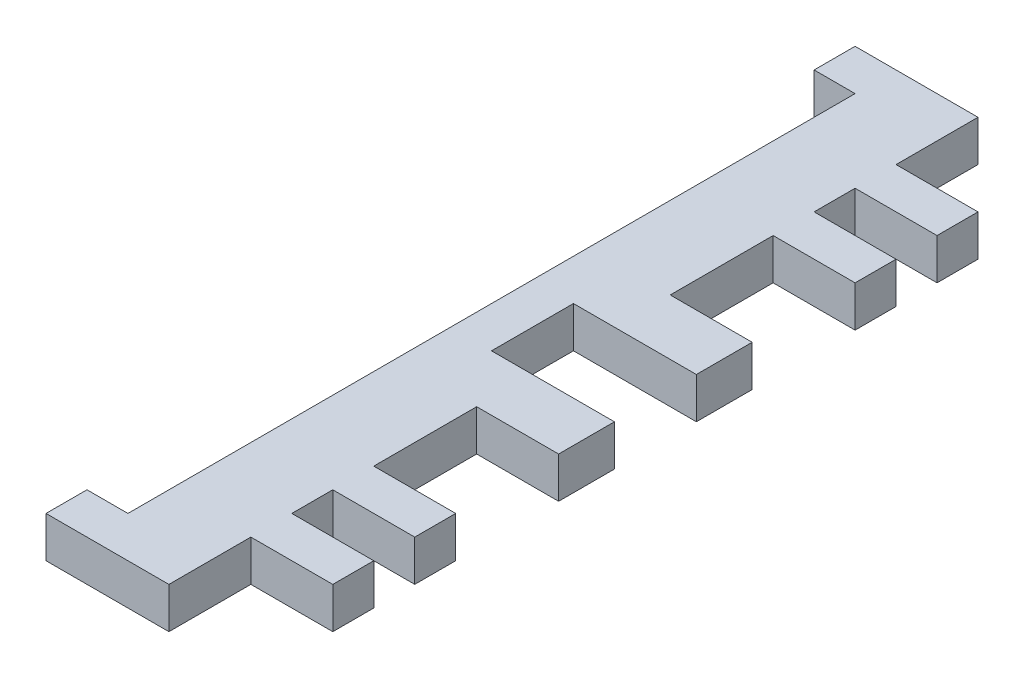
ISO-10303-21;
HEADER;
FILE_DESCRIPTION(('STEP AP214'),'2;1');
FILE_NAME('part.step','',(''),(''),'','','');
FILE_SCHEMA(('AUTOMOTIVE_DESIGN { 1 0 10303 214 1 1 1 1 }'));
ENDSEC;
DATA;
#1=APPLICATION_CONTEXT('core data for automotive mechanical design processes');
#2=APPLICATION_PROTOCOL_DEFINITION('international standard','automotive_design',2000,#1);
#3=PRODUCT_CONTEXT('',#1,'mechanical');
#4=PRODUCT('Part','Part','',(#3));
#5=PRODUCT_RELATED_PRODUCT_CATEGORY('part','',(#4));
#6=PRODUCT_DEFINITION_FORMATION('','',#4);
#7=PRODUCT_DEFINITION_CONTEXT('part definition',#1,'design');
#8=PRODUCT_DEFINITION('design','',#6,#7);
#9=PRODUCT_DEFINITION_SHAPE('','',#8);
#10=(LENGTH_UNIT() NAMED_UNIT(*) SI_UNIT(.MILLI.,.METRE.));
#11=(NAMED_UNIT(*) PLANE_ANGLE_UNIT() SI_UNIT($,.RADIAN.));
#12=(NAMED_UNIT(*) SI_UNIT($,.STERADIAN.) SOLID_ANGLE_UNIT());
#13=UNCERTAINTY_MEASURE_WITH_UNIT(LENGTH_MEASURE(1.E-05),#10,'distance_accuracy_value','');
#14=(GEOMETRIC_REPRESENTATION_CONTEXT(3) GLOBAL_UNCERTAINTY_ASSIGNED_CONTEXT((#13)) GLOBAL_UNIT_ASSIGNED_CONTEXT((#10,
#11,#12)) REPRESENTATION_CONTEXT('',''));
#15=CARTESIAN_POINT('',(0.,0.,0.));
#16=DIRECTION('',(0.,0.,1.));
#17=DIRECTION('',(1.,0.,0.));
#18=AXIS2_PLACEMENT_3D('',#15,#16,#17);
#19=CARTESIAN_POINT('',(-12.7,6.35,62.7));
#20=DIRECTION('',(0.,0.,-1.));
#21=DIRECTION('',(-1.,0.,0.));
#22=AXIS2_PLACEMENT_3D('',#19,#20,#21);
#23=PLANE('',#22);
#24=DIRECTION('',(0.,1.,0.));
#25=VECTOR('',#24,1.);
#26=CARTESIAN_POINT('',(-6.35,0.,62.7));
#27=LINE('',#26,#25);
#28=CARTESIAN_POINT('',(-6.35,0.,62.7));
#29=VERTEX_POINT('',#28);
#30=CARTESIAN_POINT('',(-6.35,6.35,62.7));
#31=VERTEX_POINT('',#30);
#32=EDGE_CURVE('E245',#29,#31,#27,.T.);
#33=ORIENTED_EDGE('',*,*,#32,.F.);
#34=DIRECTION('',(1.,0.,0.));
#35=VECTOR('',#34,1.);
#36=CARTESIAN_POINT('',(-12.7,0.,62.7));
#37=LINE('',#36,#35);
#38=CARTESIAN_POINT('',(12.7,0.,62.7));
#39=VERTEX_POINT('',#38);
#40=EDGE_CURVE('E255',#29,#39,#37,.T.);
#41=ORIENTED_EDGE('',*,*,#40,.T.);
#42=DIRECTION('',(0.,-1.,0.));
#43=VECTOR('',#42,1.);
#44=CARTESIAN_POINT('',(12.7,6.35,62.7));
#45=LINE('',#44,#43);
#46=CARTESIAN_POINT('',(12.7,6.35,62.7));
#47=VERTEX_POINT('',#46);
#48=EDGE_CURVE('E43',#47,#39,#45,.T.);
#49=ORIENTED_EDGE('',*,*,#48,.F.);
#50=DIRECTION('',(1.,0.,0.));
#51=VECTOR('',#50,1.);
#52=CARTESIAN_POINT('',(-12.7,6.35,62.7));
#53=LINE('',#52,#51);
#54=EDGE_CURVE('E257',#31,#47,#53,.T.);
#55=ORIENTED_EDGE('',*,*,#54,.F.);
#56=EDGE_LOOP('',(#33,#41,#49,#55));
#57=FACE_BOUND('',#56,.T.);
#58=ADVANCED_FACE('F35',(#57),#23,.F.);
#59=CARTESIAN_POINT('',(0.,6.35,0.));
#60=DIRECTION('',(0.,-1.,0.));
#61=DIRECTION('',(0.,0.,-1.));
#62=AXIS2_PLACEMENT_3D('',#59,#60,#61);
#63=PLANE('',#62);
#64=DIRECTION('',(0.,0.,1.));
#65=VECTOR('',#64,1.);
#66=CARTESIAN_POINT('',(-6.35,6.35,62.7));
#67=LINE('',#66,#65);
#68=CARTESIAN_POINT('',(-6.34999999999999,6.35000000000002,56.3499999999999));
#69=VERTEX_POINT('',#68);
#70=EDGE_CURVE('E50',#69,#31,#67,.T.);
#71=ORIENTED_EDGE('',*,*,#70,.T.);
#72=ORIENTED_EDGE('',*,*,#54,.T.);
#73=DIRECTION('',(0.,0.,-1.));
#74=VECTOR('',#73,1.);
#75=CARTESIAN_POINT('',(12.7,6.35,62.7));
#76=LINE('',#75,#74);
#77=CARTESIAN_POINT('',(12.7,6.35,50.));
#78=VERTEX_POINT('',#77);
#79=EDGE_CURVE('E279',#47,#78,#76,.T.);
#80=ORIENTED_EDGE('',*,*,#79,.T.);
#81=DIRECTION('',(-1.,0.,0.));
#82=VECTOR('',#81,1.);
#83=CARTESIAN_POINT('',(25.4,6.35,50.));
#84=LINE('',#83,#82);
#85=CARTESIAN_POINT('',(25.4,6.35,50.));
#86=VERTEX_POINT('',#85);
#87=EDGE_CURVE('E477',#86,#78,#84,.T.);
#88=ORIENTED_EDGE('',*,*,#87,.F.);
#89=DIRECTION('',(0.,0.,-1.));
#90=VECTOR('',#89,1.);
#91=CARTESIAN_POINT('',(25.4,6.35,43.65));
#92=LINE('',#91,#90);
#93=CARTESIAN_POINT('',(25.4,6.35,43.65));
#94=VERTEX_POINT('',#93);
#95=EDGE_CURVE('E474',#86,#94,#92,.T.);
#96=ORIENTED_EDGE('',*,*,#95,.T.);
#97=DIRECTION('',(-1.,0.,0.));
#98=VECTOR('',#97,1.);
#99=CARTESIAN_POINT('',(25.4,6.35,43.65));
#100=LINE('',#99,#98);
#101=CARTESIAN_POINT('',(12.7,6.35,43.65));
#102=VERTEX_POINT('',#101);
#103=EDGE_CURVE('E482',#94,#102,#100,.T.);
#104=ORIENTED_EDGE('',*,*,#103,.T.);
#105=CARTESIAN_POINT('',(12.7,6.35,37.3));
#106=VERTEX_POINT('',#105);
#107=EDGE_CURVE('E310',#102,#106,#76,.T.);
#108=ORIENTED_EDGE('',*,*,#107,.T.);
#109=DIRECTION('',(-1.,0.,0.));
#110=VECTOR('',#109,1.);
#111=CARTESIAN_POINT('',(25.4,6.35,37.3));
#112=LINE('',#111,#110);
#113=CARTESIAN_POINT('',(25.4,6.35,37.3));
#114=VERTEX_POINT('',#113);
#115=EDGE_CURVE('E448',#114,#106,#112,.T.);
#116=ORIENTED_EDGE('',*,*,#115,.F.);
#117=DIRECTION('',(0.,0.,-1.));
#118=VECTOR('',#117,1.);
#119=CARTESIAN_POINT('',(25.4,6.35,30.95));
#120=LINE('',#119,#118);
#121=CARTESIAN_POINT('',(25.4,6.35,30.95));
#122=VERTEX_POINT('',#121);
#123=EDGE_CURVE('E445',#114,#122,#120,.T.);
#124=ORIENTED_EDGE('',*,*,#123,.T.);
#125=DIRECTION('',(-1.,0.,0.));
#126=VECTOR('',#125,1.);
#127=CARTESIAN_POINT('',(25.4,6.35,30.95));
#128=LINE('',#127,#126);
#129=CARTESIAN_POINT('',(12.7,6.35,30.95));
#130=VERTEX_POINT('',#129);
#131=EDGE_CURVE('E454',#122,#130,#128,.T.);
#132=ORIENTED_EDGE('',*,*,#131,.T.);
#133=CARTESIAN_POINT('',(12.7,6.35,15.));
#134=VERTEX_POINT('',#133);
#135=EDGE_CURVE('E311',#130,#134,#76,.T.);
#136=ORIENTED_EDGE('',*,*,#135,.T.);
#137=DIRECTION('',(-1.,0.,0.));
#138=VECTOR('',#137,1.);
#139=CARTESIAN_POINT('',(25.4,6.35,15.));
#140=LINE('',#139,#138);
#141=CARTESIAN_POINT('',(25.4,6.35,15.));
#142=VERTEX_POINT('',#141);
#143=EDGE_CURVE('E380',#142,#134,#140,.T.);
#144=ORIENTED_EDGE('',*,*,#143,.F.);
#145=DIRECTION('',(0.,0.,1.));
#146=VECTOR('',#145,1.);
#147=CARTESIAN_POINT('',(25.4,6.35,6.35));
#148=LINE('',#147,#146);
#149=CARTESIAN_POINT('',(25.4,6.35,6.35));
#150=VERTEX_POINT('',#149);
#151=EDGE_CURVE('E378',#150,#142,#148,.T.);
#152=ORIENTED_EDGE('',*,*,#151,.F.);
#153=DIRECTION('',(1.,0.,0.));
#154=VECTOR('',#153,1.);
#155=CARTESIAN_POINT('',(6.35,6.35,6.35));
#156=LINE('',#155,#154);
#157=CARTESIAN_POINT('',(6.35,6.35,6.35));
#158=VERTEX_POINT('',#157);
#159=EDGE_CURVE('E405',#158,#150,#156,.T.);
#160=ORIENTED_EDGE('',*,*,#159,.F.);
#161=DIRECTION('',(0.,0.,1.));
#162=VECTOR('',#161,1.);
#163=CARTESIAN_POINT('',(6.35,6.35,6.35));
#164=LINE('',#163,#162);
#165=CARTESIAN_POINT('',(6.35,6.35,-6.35));
#166=VERTEX_POINT('',#165);
#167=EDGE_CURVE('E391',#166,#158,#164,.T.);
#168=ORIENTED_EDGE('',*,*,#167,.F.);
#169=DIRECTION('',(1.,0.,0.));
#170=VECTOR('',#169,1.);
#171=CARTESIAN_POINT('',(6.35,6.35,-6.35));
#172=LINE('',#171,#170);
#173=CARTESIAN_POINT('',(25.4,6.35,-6.35));
#174=VERTEX_POINT('',#173);
#175=EDGE_CURVE('E399',#166,#174,#172,.T.);
#176=ORIENTED_EDGE('',*,*,#175,.T.);
#177=DIRECTION('',(0.,0.,-1.));
#178=VECTOR('',#177,1.);
#179=CARTESIAN_POINT('',(25.4,6.35,-6.35));
#180=LINE('',#179,#178);
#181=CARTESIAN_POINT('',(25.4,6.35,-15.));
#182=VERTEX_POINT('',#181);
#183=EDGE_CURVE('E354',#174,#182,#180,.T.);
#184=ORIENTED_EDGE('',*,*,#183,.T.);
#185=DIRECTION('',(-1.,0.,0.));
#186=VECTOR('',#185,1.);
#187=CARTESIAN_POINT('',(25.4,6.35,-15.));
#188=LINE('',#187,#186);
#189=CARTESIAN_POINT('',(12.7,6.35,-15.));
#190=VERTEX_POINT('',#189);
#191=EDGE_CURVE('E366',#182,#190,#188,.T.);
#192=ORIENTED_EDGE('',*,*,#191,.T.);
#193=CARTESIAN_POINT('',(12.7,6.35,-30.95));
#194=VERTEX_POINT('',#193);
#195=EDGE_CURVE('E268',#190,#194,#76,.T.);
#196=ORIENTED_EDGE('',*,*,#195,.T.);
#197=DIRECTION('',(-1.,0.,0.));
#198=VECTOR('',#197,1.);
#199=CARTESIAN_POINT('',(25.4,6.35,-30.95));
#200=LINE('',#199,#198);
#201=CARTESIAN_POINT('',(25.4,6.35,-30.95));
#202=VERTEX_POINT('',#201);
#203=EDGE_CURVE('E509',#202,#194,#200,.T.);
#204=ORIENTED_EDGE('',*,*,#203,.F.);
#205=DIRECTION('',(0.,0.,1.));
#206=VECTOR('',#205,1.);
#207=CARTESIAN_POINT('',(25.4,6.35,-30.95));
#208=LINE('',#207,#206);
#209=CARTESIAN_POINT('',(25.4,6.35,-37.3));
#210=VERTEX_POINT('',#209);
#211=EDGE_CURVE('E494',#210,#202,#208,.T.);
#212=ORIENTED_EDGE('',*,*,#211,.F.);
#213=DIRECTION('',(-1.,0.,0.));
#214=VECTOR('',#213,1.);
#215=CARTESIAN_POINT('',(25.4,6.35,-37.3));
#216=LINE('',#215,#214);
#217=CARTESIAN_POINT('',(12.7,6.35,-37.3));
#218=VERTEX_POINT('',#217);
#219=EDGE_CURVE('E326',#210,#218,#216,.T.);
#220=ORIENTED_EDGE('',*,*,#219,.T.);
#221=CARTESIAN_POINT('',(12.7,6.35,-43.65));
#222=VERTEX_POINT('',#221);
#223=EDGE_CURVE('E266',#218,#222,#76,.T.);
#224=ORIENTED_EDGE('',*,*,#223,.T.);
#225=DIRECTION('',(-1.,0.,0.));
#226=VECTOR('',#225,1.);
#227=CARTESIAN_POINT('',(25.4,6.35,-43.65));
#228=LINE('',#227,#226);
#229=CARTESIAN_POINT('',(25.4,6.35,-43.65));
#230=VERTEX_POINT('',#229);
#231=EDGE_CURVE('E323',#230,#222,#228,.T.);
#232=ORIENTED_EDGE('',*,*,#231,.F.);
#233=DIRECTION('',(0.,0.,1.));
#234=VECTOR('',#233,1.);
#235=CARTESIAN_POINT('',(25.4,6.35,-43.65));
#236=LINE('',#235,#234);
#237=CARTESIAN_POINT('',(25.4,6.35,-50.));
#238=VERTEX_POINT('',#237);
#239=EDGE_CURVE('E514',#238,#230,#236,.T.);
#240=ORIENTED_EDGE('',*,*,#239,.F.);
#241=DIRECTION('',(-1.,0.,0.));
#242=VECTOR('',#241,1.);
#243=CARTESIAN_POINT('',(25.4,6.35,-50.));
#244=LINE('',#243,#242);
#245=CARTESIAN_POINT('',(12.7,6.35,-50.));
#246=VERTEX_POINT('',#245);
#247=EDGE_CURVE('E341',#238,#246,#244,.T.);
#248=ORIENTED_EDGE('',*,*,#247,.T.);
#249=CARTESIAN_POINT('',(12.7,6.35,-62.7));
#250=VERTEX_POINT('',#249);
#251=EDGE_CURVE('E263',#246,#250,#76,.T.);
#252=ORIENTED_EDGE('',*,*,#251,.T.);
#253=DIRECTION('',(-1.,0.,0.));
#254=VECTOR('',#253,1.);
#255=CARTESIAN_POINT('',(-12.7,6.35,-62.7));
#256=LINE('',#255,#254);
#257=CARTESIAN_POINT('',(-6.35,6.35,-62.7));
#258=VERTEX_POINT('',#257);
#259=EDGE_CURVE('E274',#250,#258,#256,.T.);
#260=ORIENTED_EDGE('',*,*,#259,.T.);
#261=DIRECTION('',(0.,0.,-1.));
#262=VECTOR('',#261,1.);
#263=CARTESIAN_POINT('',(-6.35,6.35,-62.7));
#264=LINE('',#263,#262);
#265=CARTESIAN_POINT('',(-6.34999999999999,6.35,-56.3500000000001));
#266=VERTEX_POINT('',#265);
#267=EDGE_CURVE('E424',#266,#258,#264,.T.);
#268=ORIENTED_EDGE('',*,*,#267,.F.);
#269=DIRECTION('',(-1.,0.,0.));
#270=VECTOR('',#269,1.);
#271=CARTESIAN_POINT('',(0.,6.34999999999999,-56.3500000000001));
#272=LINE('',#271,#270);
#273=CARTESIAN_POINT('',(0.,6.34999999999999,-56.3500000000001));
#274=VERTEX_POINT('',#273);
#275=EDGE_CURVE('E296',#274,#266,#272,.T.);
#276=ORIENTED_EDGE('',*,*,#275,.F.);
#277=DIRECTION('',(0.,0.,-1.));
#278=VECTOR('',#277,1.);
#279=CARTESIAN_POINT('',(0.,6.35000000000002,56.3499999999999));
#280=LINE('',#279,#278);
#281=CARTESIAN_POINT('',(0.,6.35000000000002,56.3499999999999));
#282=VERTEX_POINT('',#281);
#283=EDGE_CURVE('E412',#282,#274,#280,.T.);
#284=ORIENTED_EDGE('',*,*,#283,.F.);
#285=DIRECTION('',(-1.,0.,0.));
#286=VECTOR('',#285,1.);
#287=CARTESIAN_POINT('',(0.,6.35000000000002,56.3499999999999));
#288=LINE('',#287,#286);
#289=EDGE_CURVE('E301',#282,#69,#288,.T.);
#290=ORIENTED_EDGE('',*,*,#289,.T.);
#291=EDGE_LOOP('',(#71,#72,#80,#88,#96,#104,#108,#116,#124,#132,#136,#144,#152,#160,#168,#176,
#184,#192,#196,#204,#212,#220,#224,#232,#240,#248,#252,#260,#268,#276,#284,#290));
#292=FACE_BOUND('',#291,.T.);
#293=ADVANCED_FACE('F321',(#292),#63,.F.);
#294=CARTESIAN_POINT('',(0.,0.,0.));
#295=DIRECTION('',(0.,-1.,0.));
#296=DIRECTION('',(0.,0.,-1.));
#297=AXIS2_PLACEMENT_3D('',#294,#295,#296);
#298=PLANE('',#297);
#299=ORIENTED_EDGE('',*,*,#40,.F.);
#300=DIRECTION('',(0.,0.,1.));
#301=VECTOR('',#300,1.);
#302=CARTESIAN_POINT('',(-6.35,0.,62.7));
#303=LINE('',#302,#301);
#304=CARTESIAN_POINT('',(-6.34999999999999,0.,56.3500000000001));
#305=VERTEX_POINT('',#304);
#306=EDGE_CURVE('E242',#305,#29,#303,.T.);
#307=ORIENTED_EDGE('',*,*,#306,.F.);
#308=DIRECTION('',(-1.,0.,0.));
#309=VECTOR('',#308,1.);
#310=CARTESIAN_POINT('',(0.,0.,56.3499999999999));
#311=LINE('',#310,#309);
#312=CARTESIAN_POINT('',(0.,0.,56.3499999999999));
#313=VERTEX_POINT('',#312);
#314=EDGE_CURVE('E309',#313,#305,#311,.T.);
#315=ORIENTED_EDGE('',*,*,#314,.F.);
#316=DIRECTION('',(0.,0.,1.));
#317=VECTOR('',#316,1.);
#318=CARTESIAN_POINT('',(0.,0.,56.3499999999999));
#319=LINE('',#318,#317);
#320=CARTESIAN_POINT('',(0.,0.,-56.3500000000001));
#321=VERTEX_POINT('',#320);
#322=EDGE_CURVE('E402',#321,#313,#319,.T.);
#323=ORIENTED_EDGE('',*,*,#322,.F.);
#324=DIRECTION('',(-1.,0.,0.));
#325=VECTOR('',#324,1.);
#326=CARTESIAN_POINT('',(0.,0.,-56.3500000000001));
#327=LINE('',#326,#325);
#328=CARTESIAN_POINT('',(-6.34999999999999,0.,-56.3500000000001));
#329=VERTEX_POINT('',#328);
#330=EDGE_CURVE('E290',#321,#329,#327,.T.);
#331=ORIENTED_EDGE('',*,*,#330,.T.);
#332=DIRECTION('',(0.,0.,-1.));
#333=VECTOR('',#332,1.);
#334=CARTESIAN_POINT('',(-6.35,0.,-62.7));
#335=LINE('',#334,#333);
#336=CARTESIAN_POINT('',(-6.35,0.,-62.7));
#337=VERTEX_POINT('',#336);
#338=EDGE_CURVE('E58',#329,#337,#335,.T.);
#339=ORIENTED_EDGE('',*,*,#338,.T.);
#340=DIRECTION('',(-1.,0.,0.));
#341=VECTOR('',#340,1.);
#342=CARTESIAN_POINT('',(-12.7,0.,-62.7));
#343=LINE('',#342,#341);
#344=CARTESIAN_POINT('',(12.7,0.,-62.7));
#345=VERTEX_POINT('',#344);
#346=EDGE_CURVE('E264',#345,#337,#343,.T.);
#347=ORIENTED_EDGE('',*,*,#346,.F.);
#348=DIRECTION('',(0.,0.,-1.));
#349=VECTOR('',#348,1.);
#350=CARTESIAN_POINT('',(12.7,0.,62.7));
#351=LINE('',#350,#349);
#352=CARTESIAN_POINT('',(12.7,0.,-50.));
#353=VERTEX_POINT('',#352);
#354=EDGE_CURVE('E285',#353,#345,#351,.T.);
#355=ORIENTED_EDGE('',*,*,#354,.F.);
#356=DIRECTION('',(-1.,0.,0.));
#357=VECTOR('',#356,1.);
#358=CARTESIAN_POINT('',(25.4,0.,-50.));
#359=LINE('',#358,#357);
#360=CARTESIAN_POINT('',(25.4,0.,-50.));
#361=VERTEX_POINT('',#360);
#362=EDGE_CURVE('E347',#361,#353,#359,.T.);
#363=ORIENTED_EDGE('',*,*,#362,.F.);
#364=DIRECTION('',(0.,0.,-1.));
#365=VECTOR('',#364,1.);
#366=CARTESIAN_POINT('',(25.4,0.,-43.65));
#367=LINE('',#366,#365);
#368=CARTESIAN_POINT('',(25.4,0.,-43.65));
#369=VERTEX_POINT('',#368);
#370=EDGE_CURVE('E517',#369,#361,#367,.T.);
#371=ORIENTED_EDGE('',*,*,#370,.F.);
#372=DIRECTION('',(-1.,0.,0.));
#373=VECTOR('',#372,1.);
#374=CARTESIAN_POINT('',(25.4,0.,-43.65));
#375=LINE('',#374,#373);
#376=CARTESIAN_POINT('',(12.7,0.,-43.65));
#377=VERTEX_POINT('',#376);
#378=EDGE_CURVE('E342',#369,#377,#375,.T.);
#379=ORIENTED_EDGE('',*,*,#378,.T.);
#380=CARTESIAN_POINT('',(12.7,0.,-37.3));
#381=VERTEX_POINT('',#380);
#382=EDGE_CURVE('E284',#381,#377,#351,.T.);
#383=ORIENTED_EDGE('',*,*,#382,.F.);
#384=DIRECTION('',(-1.,0.,0.));
#385=VECTOR('',#384,1.);
#386=CARTESIAN_POINT('',(25.4,0.,-37.3));
#387=LINE('',#386,#385);
#388=CARTESIAN_POINT('',(25.4,0.,-37.3));
#389=VERTEX_POINT('',#388);
#390=EDGE_CURVE('E501',#389,#381,#387,.T.);
#391=ORIENTED_EDGE('',*,*,#390,.F.);
#392=DIRECTION('',(0.,0.,-1.));
#393=VECTOR('',#392,1.);
#394=CARTESIAN_POINT('',(25.4,0.,-30.95));
#395=LINE('',#394,#393);
#396=CARTESIAN_POINT('',(25.4,0.,-30.95));
#397=VERTEX_POINT('',#396);
#398=EDGE_CURVE('E499',#397,#389,#395,.T.);
#399=ORIENTED_EDGE('',*,*,#398,.F.);
#400=DIRECTION('',(-1.,0.,0.));
#401=VECTOR('',#400,1.);
#402=CARTESIAN_POINT('',(25.4,0.,-30.95));
#403=LINE('',#402,#401);
#404=CARTESIAN_POINT('',(12.7,0.,-30.95));
#405=VERTEX_POINT('',#404);
#406=EDGE_CURVE('E506',#397,#405,#403,.T.);
#407=ORIENTED_EDGE('',*,*,#406,.T.);
#408=CARTESIAN_POINT('',(12.7,0.,-15.));
#409=VERTEX_POINT('',#408);
#410=EDGE_CURVE('E283',#409,#405,#351,.T.);
#411=ORIENTED_EDGE('',*,*,#410,.F.);
#412=DIRECTION('',(-1.,0.,0.));
#413=VECTOR('',#412,1.);
#414=CARTESIAN_POINT('',(25.4,0.,-15.));
#415=LINE('',#414,#413);
#416=CARTESIAN_POINT('',(25.4,0.,-15.));
#417=VERTEX_POINT('',#416);
#418=EDGE_CURVE('E363',#417,#409,#415,.T.);
#419=ORIENTED_EDGE('',*,*,#418,.F.);
#420=DIRECTION('',(0.,0.,1.));
#421=VECTOR('',#420,1.);
#422=CARTESIAN_POINT('',(25.4,0.,-6.35));
#423=LINE('',#422,#421);
#424=CARTESIAN_POINT('',(25.4,0.,-6.35));
#425=VERTEX_POINT('',#424);
#426=EDGE_CURVE('E360',#417,#425,#423,.T.);
#427=ORIENTED_EDGE('',*,*,#426,.T.);
#428=DIRECTION('',(1.,0.,0.));
#429=VECTOR('',#428,1.);
#430=CARTESIAN_POINT('',(6.35,0.,-6.35));
#431=LINE('',#430,#429);
#432=CARTESIAN_POINT('',(6.35,0.,-6.35));
#433=VERTEX_POINT('',#432);
#434=EDGE_CURVE('E400',#433,#425,#431,.T.);
#435=ORIENTED_EDGE('',*,*,#434,.F.);
#436=DIRECTION('',(0.,0.,-1.));
#437=VECTOR('',#436,1.);
#438=CARTESIAN_POINT('',(6.35,0.,6.35));
#439=LINE('',#438,#437);
#440=CARTESIAN_POINT('',(6.35,0.,6.35));
#441=VERTEX_POINT('',#440);
#442=EDGE_CURVE('E396',#441,#433,#439,.T.);
#443=ORIENTED_EDGE('',*,*,#442,.F.);
#444=DIRECTION('',(1.,0.,0.));
#445=VECTOR('',#444,1.);
#446=CARTESIAN_POINT('',(6.35,0.,6.35));
#447=LINE('',#446,#445);
#448=CARTESIAN_POINT('',(25.4,0.,6.35));
#449=VERTEX_POINT('',#448);
#450=EDGE_CURVE('E403',#441,#449,#447,.T.);
#451=ORIENTED_EDGE('',*,*,#450,.T.);
#452=DIRECTION('',(0.,0.,-1.));
#453=VECTOR('',#452,1.);
#454=CARTESIAN_POINT('',(25.4,0.,6.35));
#455=LINE('',#454,#453);
#456=CARTESIAN_POINT('',(25.4,0.,15.));
#457=VERTEX_POINT('',#456);
#458=EDGE_CURVE('E372',#457,#449,#455,.T.);
#459=ORIENTED_EDGE('',*,*,#458,.F.);
#460=DIRECTION('',(-1.,0.,0.));
#461=VECTOR('',#460,1.);
#462=CARTESIAN_POINT('',(25.4,0.,15.));
#463=LINE('',#462,#461);
#464=CARTESIAN_POINT('',(12.7,0.,15.));
#465=VERTEX_POINT('',#464);
#466=EDGE_CURVE('E385',#457,#465,#463,.T.);
#467=ORIENTED_EDGE('',*,*,#466,.T.);
#468=CARTESIAN_POINT('',(12.7,0.,30.95));
#469=VERTEX_POINT('',#468);
#470=EDGE_CURVE('E282',#469,#465,#351,.T.);
#471=ORIENTED_EDGE('',*,*,#470,.F.);
#472=DIRECTION('',(-1.,0.,0.));
#473=VECTOR('',#472,1.);
#474=CARTESIAN_POINT('',(25.4,0.,30.95));
#475=LINE('',#474,#473);
#476=CARTESIAN_POINT('',(25.4,0.,30.95));
#477=VERTEX_POINT('',#476);
#478=EDGE_CURVE('E457',#477,#469,#475,.T.);
#479=ORIENTED_EDGE('',*,*,#478,.F.);
#480=DIRECTION('',(0.,0.,1.));
#481=VECTOR('',#480,1.);
#482=CARTESIAN_POINT('',(25.4,0.,30.95));
#483=LINE('',#482,#481);
#484=CARTESIAN_POINT('',(25.4,0.,37.3));
#485=VERTEX_POINT('',#484);
#486=EDGE_CURVE('E438',#477,#485,#483,.T.);
#487=ORIENTED_EDGE('',*,*,#486,.T.);
#488=DIRECTION('',(-1.,0.,0.));
#489=VECTOR('',#488,1.);
#490=CARTESIAN_POINT('',(25.4,0.,37.3));
#491=LINE('',#490,#489);
#492=CARTESIAN_POINT('',(12.7,0.,37.3));
#493=VERTEX_POINT('',#492);
#494=EDGE_CURVE('E460',#485,#493,#491,.T.);
#495=ORIENTED_EDGE('',*,*,#494,.T.);
#496=CARTESIAN_POINT('',(12.7,0.,43.65));
#497=VERTEX_POINT('',#496);
#498=EDGE_CURVE('E281',#497,#493,#351,.T.);
#499=ORIENTED_EDGE('',*,*,#498,.F.);
#500=DIRECTION('',(-1.,0.,0.));
#501=VECTOR('',#500,1.);
#502=CARTESIAN_POINT('',(25.4,0.,43.65));
#503=LINE('',#502,#501);
#504=CARTESIAN_POINT('',(25.4,0.,43.65));
#505=VERTEX_POINT('',#504);
#506=EDGE_CURVE('E485',#505,#497,#503,.T.);
#507=ORIENTED_EDGE('',*,*,#506,.F.);
#508=DIRECTION('',(0.,0.,1.));
#509=VECTOR('',#508,1.);
#510=CARTESIAN_POINT('',(25.4,0.,43.65));
#511=LINE('',#510,#509);
#512=CARTESIAN_POINT('',(25.4,0.,50.));
#513=VERTEX_POINT('',#512);
#514=EDGE_CURVE('E467',#505,#513,#511,.T.);
#515=ORIENTED_EDGE('',*,*,#514,.T.);
#516=DIRECTION('',(-1.,0.,0.));
#517=VECTOR('',#516,1.);
#518=CARTESIAN_POINT('',(25.4,0.,50.));
#519=LINE('',#518,#517);
#520=CARTESIAN_POINT('',(12.7,0.,50.));
#521=VERTEX_POINT('',#520);
#522=EDGE_CURVE('E488',#513,#521,#519,.T.);
#523=ORIENTED_EDGE('',*,*,#522,.T.);
#524=EDGE_CURVE('E262',#39,#521,#351,.T.);
#525=ORIENTED_EDGE('',*,*,#524,.F.);
#526=EDGE_LOOP('',(#299,#307,#315,#323,#331,#339,#347,#355,#363,#371,#379,#383,#391,#399,#407,
#411,#419,#427,#435,#443,#451,#459,#467,#471,#479,#487,#495,#499,#507,#515,#523,#525));
#527=FACE_BOUND('',#526,.T.);
#528=ADVANCED_FACE('F260',(#527),#298,.T.);
#529=CARTESIAN_POINT('',(0.,0.,56.3499999999999));
#530=DIRECTION('',(0.,0.,1.));
#531=DIRECTION('',(1.,0.,0.));
#532=AXIS2_PLACEMENT_3D('',#529,#530,#531);
#533=PLANE('',#532);
#534=DIRECTION('',(0.,1.,0.));
#535=VECTOR('',#534,1.);
#536=CARTESIAN_POINT('',(-6.34999999999999,0.,56.3500000000001));
#537=LINE('',#536,#535);
#538=EDGE_CURVE('E246',#305,#69,#537,.T.);
#539=ORIENTED_EDGE('',*,*,#538,.T.);
#540=ORIENTED_EDGE('',*,*,#289,.F.);
#541=DIRECTION('',(0.,1.,0.));
#542=VECTOR('',#541,1.);
#543=CARTESIAN_POINT('',(0.,0.,56.3499999999999));
#544=LINE('',#543,#542);
#545=EDGE_CURVE('E410',#313,#282,#544,.T.);
#546=ORIENTED_EDGE('',*,*,#545,.F.);
#547=ORIENTED_EDGE('',*,*,#314,.T.);
#548=EDGE_LOOP('',(#539,#540,#546,#547));
#549=FACE_BOUND('',#548,.T.);
#550=ADVANCED_FACE('F422',(#549),#533,.F.);
#551=CARTESIAN_POINT('',(12.7,6.35,62.7));
#552=DIRECTION('',(-1.,0.,0.));
#553=DIRECTION('',(0.,0.,1.));
#554=AXIS2_PLACEMENT_3D('',#551,#552,#553);
#555=PLANE('',#554);
#556=ORIENTED_EDGE('',*,*,#498,.T.);
#557=DIRECTION('',(0.,1.,0.));
#558=VECTOR('',#557,1.);
#559=CARTESIAN_POINT('',(12.7,0.,37.3));
#560=LINE('',#559,#558);
#561=EDGE_CURVE('E433',#493,#106,#560,.T.);
#562=ORIENTED_EDGE('',*,*,#561,.T.);
#563=ORIENTED_EDGE('',*,*,#107,.F.);
#564=DIRECTION('',(0.,-1.,0.));
#565=VECTOR('',#564,1.);
#566=CARTESIAN_POINT('',(12.7,0.,43.65));
#567=LINE('',#566,#565);
#568=EDGE_CURVE('E468',#102,#497,#567,.T.);
#569=ORIENTED_EDGE('',*,*,#568,.T.);
#570=EDGE_LOOP('',(#556,#562,#563,#569));
#571=FACE_BOUND('',#570,.T.);
#572=ADVANCED_FACE('F586',(#571),#555,.F.);
#573=ORIENTED_EDGE('',*,*,#524,.T.);
#574=DIRECTION('',(0.,1.,0.));
#575=VECTOR('',#574,1.);
#576=CARTESIAN_POINT('',(12.7,0.,50.));
#577=LINE('',#576,#575);
#578=EDGE_CURVE('E463',#521,#78,#577,.T.);
#579=ORIENTED_EDGE('',*,*,#578,.T.);
#580=ORIENTED_EDGE('',*,*,#79,.F.);
#581=ORIENTED_EDGE('',*,*,#48,.T.);
#582=EDGE_LOOP('',(#573,#579,#580,#581));
#583=FACE_BOUND('',#582,.T.);
#584=ADVANCED_FACE('F599',(#583),#555,.F.);
#585=DIRECTION('',(0.,1.,0.));
#586=VECTOR('',#585,1.);
#587=CARTESIAN_POINT('',(12.7,0.,-37.3));
#588=LINE('',#587,#586);
#589=EDGE_CURVE('E490',#381,#218,#588,.T.);
#590=ORIENTED_EDGE('',*,*,#589,.F.);
#591=ORIENTED_EDGE('',*,*,#382,.T.);
#592=DIRECTION('',(0.,-1.,0.));
#593=VECTOR('',#592,1.);
#594=CARTESIAN_POINT('',(12.7,0.,-43.65));
#595=LINE('',#594,#593);
#596=EDGE_CURVE('E331',#222,#377,#595,.T.);
#597=ORIENTED_EDGE('',*,*,#596,.F.);
#598=ORIENTED_EDGE('',*,*,#223,.F.);
#599=EDGE_LOOP('',(#590,#591,#597,#598));
#600=FACE_BOUND('',#599,.T.);
#601=ADVANCED_FACE('F332',(#600),#555,.F.);
#602=DIRECTION('',(0.,-1.,0.));
#603=VECTOR('',#602,1.);
#604=CARTESIAN_POINT('',(12.7,0.,-30.95));
#605=LINE('',#604,#603);
#606=EDGE_CURVE('E495',#194,#405,#605,.T.);
#607=ORIENTED_EDGE('',*,*,#606,.F.);
#608=ORIENTED_EDGE('',*,*,#195,.F.);
#609=DIRECTION('',(0.,-1.,0.));
#610=VECTOR('',#609,1.);
#611=CARTESIAN_POINT('',(12.7,0.,-15.));
#612=LINE('',#611,#610);
#613=EDGE_CURVE('E345',#190,#409,#612,.T.);
#614=ORIENTED_EDGE('',*,*,#613,.T.);
#615=ORIENTED_EDGE('',*,*,#410,.T.);
#616=EDGE_LOOP('',(#607,#608,#614,#615));
#617=FACE_BOUND('',#616,.T.);
#618=ADVANCED_FACE('F541',(#617),#555,.F.);
#619=DIRECTION('',(0.,1.,0.));
#620=VECTOR('',#619,1.);
#621=CARTESIAN_POINT('',(12.7,0.,-50.));
#622=LINE('',#621,#620);
#623=EDGE_CURVE('E337',#353,#246,#622,.T.);
#624=ORIENTED_EDGE('',*,*,#623,.F.);
#625=ORIENTED_EDGE('',*,*,#354,.T.);
#626=DIRECTION('',(0.,-1.,0.));
#627=VECTOR('',#626,1.);
#628=CARTESIAN_POINT('',(12.7,6.35,-62.7));
#629=LINE('',#628,#627);
#630=EDGE_CURVE('E11',#250,#345,#629,.T.);
#631=ORIENTED_EDGE('',*,*,#630,.F.);
#632=ORIENTED_EDGE('',*,*,#251,.F.);
#633=EDGE_LOOP('',(#624,#625,#631,#632));
#634=FACE_BOUND('',#633,.T.);
#635=ADVANCED_FACE('F527',(#634),#555,.F.);
#636=ORIENTED_EDGE('',*,*,#135,.F.);
#637=DIRECTION('',(0.,-1.,0.));
#638=VECTOR('',#637,1.);
#639=CARTESIAN_POINT('',(12.7,0.,30.95));
#640=LINE('',#639,#638);
#641=EDGE_CURVE('E439',#130,#469,#640,.T.);
#642=ORIENTED_EDGE('',*,*,#641,.T.);
#643=ORIENTED_EDGE('',*,*,#470,.T.);
#644=DIRECTION('',(0.,-1.,0.));
#645=VECTOR('',#644,1.);
#646=CARTESIAN_POINT('',(12.7,0.,15.));
#647=LINE('',#646,#645);
#648=EDGE_CURVE('E368',#134,#465,#647,.T.);
#649=ORIENTED_EDGE('',*,*,#648,.F.);
#650=EDGE_LOOP('',(#636,#642,#643,#649));
#651=FACE_BOUND('',#650,.T.);
#652=ADVANCED_FACE('F37',(#651),#555,.F.);
#653=CARTESIAN_POINT('',(-12.7,6.35,-62.7));
#654=DIRECTION('',(0.,0.,1.));
#655=DIRECTION('',(1.,0.,0.));
#656=AXIS2_PLACEMENT_3D('',#653,#654,#655);
#657=PLANE('',#656);
#658=ORIENTED_EDGE('',*,*,#346,.T.);
#659=DIRECTION('',(0.,1.,0.));
#660=VECTOR('',#659,1.);
#661=CARTESIAN_POINT('',(-6.35,0.,-62.7));
#662=LINE('',#661,#660);
#663=EDGE_CURVE('E431',#337,#258,#662,.T.);
#664=ORIENTED_EDGE('',*,*,#663,.T.);
#665=ORIENTED_EDGE('',*,*,#259,.F.);
#666=ORIENTED_EDGE('',*,*,#630,.T.);
#667=EDGE_LOOP('',(#658,#664,#665,#666));
#668=FACE_BOUND('',#667,.T.);
#669=ADVANCED_FACE('F614',(#668),#657,.F.);
#670=CARTESIAN_POINT('',(0.,0.,-56.3500000000001));
#671=DIRECTION('',(0.,0.,-1.));
#672=DIRECTION('',(-1.,0.,0.));
#673=AXIS2_PLACEMENT_3D('',#670,#671,#672);
#674=PLANE('',#673);
#675=ORIENTED_EDGE('',*,*,#275,.T.);
#676=DIRECTION('',(0.,1.,0.));
#677=VECTOR('',#676,1.);
#678=CARTESIAN_POINT('',(-6.34999999999999,0.,-56.3500000000001));
#679=LINE('',#678,#677);
#680=EDGE_CURVE('E420',#329,#266,#679,.T.);
#681=ORIENTED_EDGE('',*,*,#680,.F.);
#682=ORIENTED_EDGE('',*,*,#330,.F.);
#683=DIRECTION('',(0.,-1.,0.));
#684=VECTOR('',#683,1.);
#685=CARTESIAN_POINT('',(0.,0.,-56.3500000000001));
#686=LINE('',#685,#684);
#687=EDGE_CURVE('E304',#274,#321,#686,.T.);
#688=ORIENTED_EDGE('',*,*,#687,.F.);
#689=EDGE_LOOP('',(#675,#681,#682,#688));
#690=FACE_BOUND('',#689,.T.);
#691=ADVANCED_FACE('F419',(#690),#674,.F.);
#692=CARTESIAN_POINT('',(0.,0.,0.));
#693=DIRECTION('',(1.,0.,0.));
#694=DIRECTION('',(0.,0.,-1.));
#695=AXIS2_PLACEMENT_3D('',#692,#693,#694);
#696=PLANE('',#695);
#697=ORIENTED_EDGE('',*,*,#322,.T.);
#698=ORIENTED_EDGE('',*,*,#545,.T.);
#699=ORIENTED_EDGE('',*,*,#283,.T.);
#700=ORIENTED_EDGE('',*,*,#687,.T.);
#701=EDGE_LOOP('',(#697,#698,#699,#700));
#702=FACE_BOUND('',#701,.T.);
#703=ADVANCED_FACE('F416',(#702),#696,.F.);
#704=CARTESIAN_POINT('',(6.35,0.,-6.35));
#705=DIRECTION('',(0.,0.,-1.));
#706=DIRECTION('',(-1.,0.,0.));
#707=AXIS2_PLACEMENT_3D('',#704,#705,#706);
#708=PLANE('',#707);
#709=ORIENTED_EDGE('',*,*,#434,.T.);
#710=DIRECTION('',(0.,1.,0.));
#711=VECTOR('',#710,1.);
#712=CARTESIAN_POINT('',(25.4,0.,-6.35));
#713=LINE('',#712,#711);
#714=EDGE_CURVE('E357',#425,#174,#713,.T.);
#715=ORIENTED_EDGE('',*,*,#714,.T.);
#716=ORIENTED_EDGE('',*,*,#175,.F.);
#717=DIRECTION('',(0.,1.,0.));
#718=VECTOR('',#717,1.);
#719=CARTESIAN_POINT('',(6.35,0.,-6.35));
#720=LINE('',#719,#718);
#721=EDGE_CURVE('E388',#433,#166,#720,.T.);
#722=ORIENTED_EDGE('',*,*,#721,.F.);
#723=EDGE_LOOP('',(#709,#715,#716,#722));
#724=FACE_BOUND('',#723,.T.);
#725=ADVANCED_FACE('F554',(#724),#708,.F.);
#726=CARTESIAN_POINT('',(6.35,0.,6.35));
#727=DIRECTION('',(0.,0.,1.));
#728=DIRECTION('',(1.,0.,0.));
#729=AXIS2_PLACEMENT_3D('',#726,#727,#728);
#730=PLANE('',#729);
#731=ORIENTED_EDGE('',*,*,#159,.T.);
#732=DIRECTION('',(0.,1.,0.));
#733=VECTOR('',#732,1.);
#734=CARTESIAN_POINT('',(25.4,0.,6.35));
#735=LINE('',#734,#733);
#736=EDGE_CURVE('E375',#449,#150,#735,.T.);
#737=ORIENTED_EDGE('',*,*,#736,.F.);
#738=ORIENTED_EDGE('',*,*,#450,.F.);
#739=DIRECTION('',(0.,-1.,0.));
#740=VECTOR('',#739,1.);
#741=CARTESIAN_POINT('',(6.35,0.,6.35));
#742=LINE('',#741,#740);
#743=EDGE_CURVE('E394',#158,#441,#742,.T.);
#744=ORIENTED_EDGE('',*,*,#743,.F.);
#745=EDGE_LOOP('',(#731,#737,#738,#744));
#746=FACE_BOUND('',#745,.T.);
#747=ADVANCED_FACE('F566',(#746),#730,.F.);
#748=CARTESIAN_POINT('',(6.35,0.,0.));
#749=DIRECTION('',(-1.,0.,0.));
#750=DIRECTION('',(0.,0.,1.));
#751=AXIS2_PLACEMENT_3D('',#748,#749,#750);
#752=PLANE('',#751);
#753=ORIENTED_EDGE('',*,*,#721,.T.);
#754=ORIENTED_EDGE('',*,*,#167,.T.);
#755=ORIENTED_EDGE('',*,*,#743,.T.);
#756=ORIENTED_EDGE('',*,*,#442,.T.);
#757=EDGE_LOOP('',(#753,#754,#755,#756));
#758=FACE_BOUND('',#757,.T.);
#759=ADVANCED_FACE('F557',(#758),#752,.F.);
#760=CARTESIAN_POINT('',(25.4,0.,15.));
#761=DIRECTION('',(0.,0.,-1.));
#762=DIRECTION('',(-1.,0.,0.));
#763=AXIS2_PLACEMENT_3D('',#760,#761,#762);
#764=PLANE('',#763);
#765=ORIENTED_EDGE('',*,*,#648,.T.);
#766=ORIENTED_EDGE('',*,*,#466,.F.);
#767=DIRECTION('',(0.,-1.,0.));
#768=VECTOR('',#767,1.);
#769=CARTESIAN_POINT('',(25.4,0.,15.));
#770=LINE('',#769,#768);
#771=EDGE_CURVE('E369',#142,#457,#770,.T.);
#772=ORIENTED_EDGE('',*,*,#771,.F.);
#773=ORIENTED_EDGE('',*,*,#143,.T.);
#774=EDGE_LOOP('',(#765,#766,#772,#773));
#775=FACE_BOUND('',#774,.T.);
#776=ADVANCED_FACE('F571',(#775),#764,.F.);
#777=CARTESIAN_POINT('',(25.4,0.,0.));
#778=DIRECTION('',(1.,0.,0.));
#779=DIRECTION('',(0.,0.,-1.));
#780=AXIS2_PLACEMENT_3D('',#777,#778,#779);
#781=PLANE('',#780);
#782=ORIENTED_EDGE('',*,*,#771,.T.);
#783=ORIENTED_EDGE('',*,*,#458,.T.);
#784=ORIENTED_EDGE('',*,*,#736,.T.);
#785=ORIENTED_EDGE('',*,*,#151,.T.);
#786=EDGE_LOOP('',(#782,#783,#784,#785));
#787=FACE_BOUND('',#786,.T.);
#788=ADVANCED_FACE('F562',(#787),#781,.T.);
#789=CARTESIAN_POINT('',(25.4,0.,-15.));
#790=DIRECTION('',(0.,0.,-1.));
#791=DIRECTION('',(-1.,0.,0.));
#792=AXIS2_PLACEMENT_3D('',#789,#790,#791);
#793=PLANE('',#792);
#794=ORIENTED_EDGE('',*,*,#613,.F.);
#795=ORIENTED_EDGE('',*,*,#191,.F.);
#796=DIRECTION('',(0.,-1.,0.));
#797=VECTOR('',#796,1.);
#798=CARTESIAN_POINT('',(25.4,0.,-15.));
#799=LINE('',#798,#797);
#800=EDGE_CURVE('E351',#182,#417,#799,.T.);
#801=ORIENTED_EDGE('',*,*,#800,.T.);
#802=ORIENTED_EDGE('',*,*,#418,.T.);
#803=EDGE_LOOP('',(#794,#795,#801,#802));
#804=FACE_BOUND('',#803,.T.);
#805=ADVANCED_FACE('F544',(#804),#793,.T.);
#806=CARTESIAN_POINT('',(25.4,0.,0.));
#807=DIRECTION('',(1.,0.,0.));
#808=DIRECTION('',(0.,0.,1.));
#809=AXIS2_PLACEMENT_3D('',#806,#807,#808);
#810=PLANE('',#809);
#811=ORIENTED_EDGE('',*,*,#800,.F.);
#812=ORIENTED_EDGE('',*,*,#183,.F.);
#813=ORIENTED_EDGE('',*,*,#714,.F.);
#814=ORIENTED_EDGE('',*,*,#426,.F.);
#815=EDGE_LOOP('',(#811,#812,#813,#814));
#816=FACE_BOUND('',#815,.T.);
#817=ADVANCED_FACE('F551',(#816),#810,.T.);
#818=CARTESIAN_POINT('',(25.4,0.,-50.));
#819=DIRECTION('',(0.,0.,1.));
#820=DIRECTION('',(1.,0.,0.));
#821=AXIS2_PLACEMENT_3D('',#818,#819,#820);
#822=PLANE('',#821);
#823=ORIENTED_EDGE('',*,*,#623,.T.);
#824=ORIENTED_EDGE('',*,*,#247,.F.);
#825=DIRECTION('',(0.,1.,0.));
#826=VECTOR('',#825,1.);
#827=CARTESIAN_POINT('',(25.4,0.,-50.));
#828=LINE('',#827,#826);
#829=EDGE_CURVE('E336',#361,#238,#828,.T.);
#830=ORIENTED_EDGE('',*,*,#829,.F.);
#831=ORIENTED_EDGE('',*,*,#362,.T.);
#832=EDGE_LOOP('',(#823,#824,#830,#831));
#833=FACE_BOUND('',#832,.T.);
#834=ADVANCED_FACE('F524',(#833),#822,.F.);
#835=CARTESIAN_POINT('',(25.4,0.,-43.65));
#836=DIRECTION('',(0.,0.,-1.));
#837=DIRECTION('',(-1.,0.,0.));
#838=AXIS2_PLACEMENT_3D('',#835,#836,#837);
#839=PLANE('',#838);
#840=ORIENTED_EDGE('',*,*,#596,.T.);
#841=ORIENTED_EDGE('',*,*,#378,.F.);
#842=DIRECTION('',(0.,-1.,0.));
#843=VECTOR('',#842,1.);
#844=CARTESIAN_POINT('',(25.4,0.,-43.65));
#845=LINE('',#844,#843);
#846=EDGE_CURVE('E340',#230,#369,#845,.T.);
#847=ORIENTED_EDGE('',*,*,#846,.F.);
#848=ORIENTED_EDGE('',*,*,#231,.T.);
#849=EDGE_LOOP('',(#840,#841,#847,#848));
#850=FACE_BOUND('',#849,.T.);
#851=ADVANCED_FACE('F339',(#850),#839,.F.);
#852=CARTESIAN_POINT('',(25.4,0.,0.));
#853=DIRECTION('',(-1.,0.,0.));
#854=DIRECTION('',(0.,0.,1.));
#855=AXIS2_PLACEMENT_3D('',#852,#853,#854);
#856=PLANE('',#855);
#857=ORIENTED_EDGE('',*,*,#829,.T.);
#858=ORIENTED_EDGE('',*,*,#239,.T.);
#859=ORIENTED_EDGE('',*,*,#846,.T.);
#860=ORIENTED_EDGE('',*,*,#370,.T.);
#861=EDGE_LOOP('',(#857,#858,#859,#860));
#862=FACE_BOUND('',#861,.T.);
#863=ADVANCED_FACE('F529',(#862),#856,.F.);
#864=CARTESIAN_POINT('',(25.4,0.,-37.3));
#865=DIRECTION('',(0.,0.,1.));
#866=DIRECTION('',(1.,0.,0.));
#867=AXIS2_PLACEMENT_3D('',#864,#865,#866);
#868=PLANE('',#867);
#869=ORIENTED_EDGE('',*,*,#589,.T.);
#870=ORIENTED_EDGE('',*,*,#219,.F.);
#871=DIRECTION('',(0.,1.,0.));
#872=VECTOR('',#871,1.);
#873=CARTESIAN_POINT('',(25.4,0.,-37.3));
#874=LINE('',#873,#872);
#875=EDGE_CURVE('E491',#389,#210,#874,.T.);
#876=ORIENTED_EDGE('',*,*,#875,.F.);
#877=ORIENTED_EDGE('',*,*,#390,.T.);
#878=EDGE_LOOP('',(#869,#870,#876,#877));
#879=FACE_BOUND('',#878,.T.);
#880=ADVANCED_FACE('F534',(#879),#868,.F.);
#881=CARTESIAN_POINT('',(25.4,0.,-30.95));
#882=DIRECTION('',(0.,0.,-1.));
#883=DIRECTION('',(-1.,0.,0.));
#884=AXIS2_PLACEMENT_3D('',#881,#882,#883);
#885=PLANE('',#884);
#886=ORIENTED_EDGE('',*,*,#606,.T.);
#887=ORIENTED_EDGE('',*,*,#406,.F.);
#888=DIRECTION('',(0.,-1.,0.));
#889=VECTOR('',#888,1.);
#890=CARTESIAN_POINT('',(25.4,0.,-30.95));
#891=LINE('',#890,#889);
#892=EDGE_CURVE('E497',#202,#397,#891,.T.);
#893=ORIENTED_EDGE('',*,*,#892,.F.);
#894=ORIENTED_EDGE('',*,*,#203,.T.);
#895=EDGE_LOOP('',(#886,#887,#893,#894));
#896=FACE_BOUND('',#895,.T.);
#897=ADVANCED_FACE('F540',(#896),#885,.F.);
#898=CARTESIAN_POINT('',(25.4,0.,0.));
#899=DIRECTION('',(-1.,0.,0.));
#900=DIRECTION('',(0.,0.,1.));
#901=AXIS2_PLACEMENT_3D('',#898,#899,#900);
#902=PLANE('',#901);
#903=ORIENTED_EDGE('',*,*,#875,.T.);
#904=ORIENTED_EDGE('',*,*,#211,.T.);
#905=ORIENTED_EDGE('',*,*,#892,.T.);
#906=ORIENTED_EDGE('',*,*,#398,.T.);
#907=EDGE_LOOP('',(#903,#904,#905,#906));
#908=FACE_BOUND('',#907,.T.);
#909=ADVANCED_FACE('F536',(#908),#902,.F.);
#910=CARTESIAN_POINT('',(25.4,0.,50.));
#911=DIRECTION('',(0.,0.,1.));
#912=DIRECTION('',(1.,0.,0.));
#913=AXIS2_PLACEMENT_3D('',#910,#911,#912);
#914=PLANE('',#913);
#915=ORIENTED_EDGE('',*,*,#578,.F.);
#916=ORIENTED_EDGE('',*,*,#522,.F.);
#917=DIRECTION('',(0.,1.,0.));
#918=VECTOR('',#917,1.);
#919=CARTESIAN_POINT('',(25.4,0.,50.));
#920=LINE('',#919,#918);
#921=EDGE_CURVE('E464',#513,#86,#920,.T.);
#922=ORIENTED_EDGE('',*,*,#921,.T.);
#923=ORIENTED_EDGE('',*,*,#87,.T.);
#924=EDGE_LOOP('',(#915,#916,#922,#923));
#925=FACE_BOUND('',#924,.T.);
#926=ADVANCED_FACE('F598',(#925),#914,.T.);
#927=CARTESIAN_POINT('',(25.4,0.,43.65));
#928=DIRECTION('',(0.,0.,-1.));
#929=DIRECTION('',(-1.,0.,0.));
#930=AXIS2_PLACEMENT_3D('',#927,#928,#929);
#931=PLANE('',#930);
#932=ORIENTED_EDGE('',*,*,#568,.F.);
#933=ORIENTED_EDGE('',*,*,#103,.F.);
#934=DIRECTION('',(0.,-1.,0.));
#935=VECTOR('',#934,1.);
#936=CARTESIAN_POINT('',(25.4,0.,43.65));
#937=LINE('',#936,#935);
#938=EDGE_CURVE('E471',#94,#505,#937,.T.);
#939=ORIENTED_EDGE('',*,*,#938,.T.);
#940=ORIENTED_EDGE('',*,*,#506,.T.);
#941=EDGE_LOOP('',(#932,#933,#939,#940));
#942=FACE_BOUND('',#941,.T.);
#943=ADVANCED_FACE('F589',(#942),#931,.T.);
#944=CARTESIAN_POINT('',(25.4,0.,0.));
#945=DIRECTION('',(-1.,0.,0.));
#946=DIRECTION('',(0.,0.,-1.));
#947=AXIS2_PLACEMENT_3D('',#944,#945,#946);
#948=PLANE('',#947);
#949=ORIENTED_EDGE('',*,*,#921,.F.);
#950=ORIENTED_EDGE('',*,*,#514,.F.);
#951=ORIENTED_EDGE('',*,*,#938,.F.);
#952=ORIENTED_EDGE('',*,*,#95,.F.);
#953=EDGE_LOOP('',(#949,#950,#951,#952));
#954=FACE_BOUND('',#953,.T.);
#955=ADVANCED_FACE('F594',(#954),#948,.F.);
#956=CARTESIAN_POINT('',(25.4,0.,37.3));
#957=DIRECTION('',(0.,0.,1.));
#958=DIRECTION('',(1.,0.,0.));
#959=AXIS2_PLACEMENT_3D('',#956,#957,#958);
#960=PLANE('',#959);
#961=ORIENTED_EDGE('',*,*,#561,.F.);
#962=ORIENTED_EDGE('',*,*,#494,.F.);
#963=DIRECTION('',(0.,1.,0.));
#964=VECTOR('',#963,1.);
#965=CARTESIAN_POINT('',(25.4,0.,37.3));
#966=LINE('',#965,#964);
#967=EDGE_CURVE('E435',#485,#114,#966,.T.);
#968=ORIENTED_EDGE('',*,*,#967,.T.);
#969=ORIENTED_EDGE('',*,*,#115,.T.);
#970=EDGE_LOOP('',(#961,#962,#968,#969));
#971=FACE_BOUND('',#970,.T.);
#972=ADVANCED_FACE('F584',(#971),#960,.T.);
#973=CARTESIAN_POINT('',(25.4,0.,30.95));
#974=DIRECTION('',(0.,0.,-1.));
#975=DIRECTION('',(-1.,0.,0.));
#976=AXIS2_PLACEMENT_3D('',#973,#974,#975);
#977=PLANE('',#976);
#978=ORIENTED_EDGE('',*,*,#641,.F.);
#979=ORIENTED_EDGE('',*,*,#131,.F.);
#980=DIRECTION('',(0.,-1.,0.));
#981=VECTOR('',#980,1.);
#982=CARTESIAN_POINT('',(25.4,0.,30.95));
#983=LINE('',#982,#981);
#984=EDGE_CURVE('E442',#122,#477,#983,.T.);
#985=ORIENTED_EDGE('',*,*,#984,.T.);
#986=ORIENTED_EDGE('',*,*,#478,.T.);
#987=EDGE_LOOP('',(#978,#979,#985,#986));
#988=FACE_BOUND('',#987,.T.);
#989=ADVANCED_FACE('F576',(#988),#977,.T.);
#990=CARTESIAN_POINT('',(25.4,0.,0.));
#991=DIRECTION('',(-1.,0.,0.));
#992=DIRECTION('',(0.,0.,-1.));
#993=AXIS2_PLACEMENT_3D('',#990,#991,#992);
#994=PLANE('',#993);
#995=ORIENTED_EDGE('',*,*,#967,.F.);
#996=ORIENTED_EDGE('',*,*,#486,.F.);
#997=ORIENTED_EDGE('',*,*,#984,.F.);
#998=ORIENTED_EDGE('',*,*,#123,.F.);
#999=EDGE_LOOP('',(#995,#996,#997,#998));
#1000=FACE_BOUND('',#999,.T.);
#1001=ADVANCED_FACE('F581',(#1000),#994,.F.);
#1002=CARTESIAN_POINT('',(-6.35,0.,-62.7));
#1003=DIRECTION('',(1.,0.,0.));
#1004=DIRECTION('',(0.,0.,-1.));
#1005=AXIS2_PLACEMENT_3D('',#1002,#1003,#1004);
#1006=PLANE('',#1005);
#1007=ORIENTED_EDGE('',*,*,#267,.T.);
#1008=ORIENTED_EDGE('',*,*,#663,.F.);
#1009=ORIENTED_EDGE('',*,*,#338,.F.);
#1010=ORIENTED_EDGE('',*,*,#680,.T.);
#1011=EDGE_LOOP('',(#1007,#1008,#1009,#1010));
#1012=FACE_BOUND('',#1011,.T.);
#1013=ADVANCED_FACE('F622',(#1012),#1006,.F.);
#1014=CARTESIAN_POINT('',(-6.35,0.,62.7));
#1015=DIRECTION('',(-1.,0.,0.));
#1016=DIRECTION('',(0.,0.,1.));
#1017=AXIS2_PLACEMENT_3D('',#1014,#1015,#1016);
#1018=PLANE('',#1017);
#1019=ORIENTED_EDGE('',*,*,#70,.F.);
#1020=ORIENTED_EDGE('',*,*,#538,.F.);
#1021=ORIENTED_EDGE('',*,*,#306,.T.);
#1022=ORIENTED_EDGE('',*,*,#32,.T.);
#1023=EDGE_LOOP('',(#1019,#1020,#1021,#1022));
#1024=FACE_BOUND('',#1023,.T.);
#1025=ADVANCED_FACE('F244',(#1024),#1018,.T.);
#1026=CLOSED_SHELL('',(#58,#293,#528,#550,#572,#584,#601,#618,#635,#652,#669,#691,#703,#725,
#747,#759,#776,#788,#805,#817,#834,#851,#863,#880,#897,#909,#926,#943,#955,#972,#989,#1001,
#1013,#1025));
#1027=MANIFOLD_SOLID_BREP('B2',#1026);
#1028=ADVANCED_BREP_SHAPE_REPRESENTATION('',(#18,#1027),#14);
#1029=SHAPE_DEFINITION_REPRESENTATION(#9,#1028);
ENDSEC;
END-ISO-10303-21;
